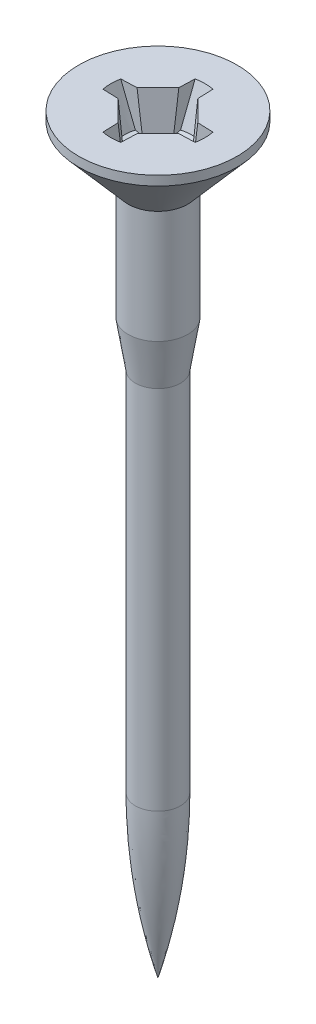
ISO-10303-21;
HEADER;
FILE_DESCRIPTION(('STEP AP214'),'2;1');
FILE_NAME('part.step','',(''),(''),'','','');
FILE_SCHEMA(('AUTOMOTIVE_DESIGN { 1 0 10303 214 1 1 1 1 }'));
ENDSEC;
DATA;
#1=APPLICATION_CONTEXT('core data for automotive mechanical design processes');
#2=APPLICATION_PROTOCOL_DEFINITION('international standard','automotive_design',2000,#1);
#3=PRODUCT_CONTEXT('',#1,'mechanical');
#4=PRODUCT('Part','Part','',(#3));
#5=PRODUCT_RELATED_PRODUCT_CATEGORY('part','',(#4));
#6=PRODUCT_DEFINITION_FORMATION('','',#4);
#7=PRODUCT_DEFINITION_CONTEXT('part definition',#1,'design');
#8=PRODUCT_DEFINITION('design','',#6,#7);
#9=PRODUCT_DEFINITION_SHAPE('','',#8);
#10=(LENGTH_UNIT() NAMED_UNIT(*) SI_UNIT(.MILLI.,.METRE.));
#11=(NAMED_UNIT(*) PLANE_ANGLE_UNIT() SI_UNIT($,.RADIAN.));
#12=(NAMED_UNIT(*) SI_UNIT($,.STERADIAN.) SOLID_ANGLE_UNIT());
#13=UNCERTAINTY_MEASURE_WITH_UNIT(LENGTH_MEASURE(1.E-05),#10,'distance_accuracy_value','');
#14=(GEOMETRIC_REPRESENTATION_CONTEXT(3) GLOBAL_UNCERTAINTY_ASSIGNED_CONTEXT((#13)) GLOBAL_UNIT_ASSIGNED_CONTEXT((#10,
#11,#12)) REPRESENTATION_CONTEXT('',''));
#15=CARTESIAN_POINT('',(0.,0.,0.));
#16=DIRECTION('',(0.,0.,1.));
#17=DIRECTION('',(1.,0.,0.));
#18=AXIS2_PLACEMENT_3D('',#15,#16,#17);
#19=CARTESIAN_POINT('',(-3.77475828372553E-12,-3.7549544092178,1.11022302462516E-12));
#20=DIRECTION('',(0.,1.00000000000008,0.));
#21=DIRECTION('',(0.,0.,1.00000000000013));
#22=AXIS2_PLACEMENT_3D('',#19,#20,#21);
#23=CONICAL_SURFACE('',#22,1.38691129987025,0.715584993317677);
#24=CARTESIAN_POINT('',(-4.21884749357559E-12,-0.500000000002054,0.));
#25=DIRECTION('',(0.,1.00000000000008,0.));
#26=DIRECTION('',(0.,0.,1.00000000000013));
#27=AXIS2_PLACEMENT_3D('',#24,#25,#26);
#28=CIRCLE('',#27,4.2164);
#29=CARTESIAN_POINT('',(-4.2406733291589E-12,-0.50000000000206,4.21640000000054));
#30=VERTEX_POINT('',#29);
#31=EDGE_CURVE('E1593',#30,#30,#28,.T.);
#32=ORIENTED_EDGE('',*,*,#31,.F.);
#33=EDGE_LOOP('',(#32));
#34=FACE_BOUND('',#33,.T.);
#35=CARTESIAN_POINT('',(-5.32907051820075E-12,-3.5242035057429,1.99840144432528E-12));
#36=DIRECTION('',(0.,1.00000000000008,0.));
#37=DIRECTION('',(0.,0.,1.00000000000013));
#38=AXIS2_PLACEMENT_3D('',#35,#36,#37);
#39=CIRCLE('',#38,1.5875);
#40=CARTESIAN_POINT('',(-5.3372880767788E-12,-3.5242035057429,1.5875000000022));
#41=VERTEX_POINT('',#40);
#42=EDGE_CURVE('E1187',#41,#41,#39,.F.);
#43=ORIENTED_EDGE('',*,*,#42,.F.);
#44=EDGE_LOOP('',(#43));
#45=FACE_BOUND('',#44,.T.);
#46=ADVANCED_FACE('F1228',(#34,#45),#23,.T.);
#47=CARTESIAN_POINT('',(0.,0.,0.));
#48=DIRECTION('',(0.,-1.00000000000008,0.));
#49=DIRECTION('',(0.,0.,-1.00000000000013));
#50=AXIS2_PLACEMENT_3D('',#47,#48,#49);
#51=PLANE('',#50);
#52=CARTESIAN_POINT('',(0.,0.,0.));
#53=DIRECTION('',(0.,1.00000000000008,0.));
#54=DIRECTION('',(0.,0.,1.00000000000013));
#55=AXIS2_PLACEMENT_3D('',#52,#53,#54);
#56=CIRCLE('',#55,4.2164);
#57=CARTESIAN_POINT('',(0.,0.,4.21640000000054));
#58=VERTEX_POINT('',#57);
#59=EDGE_CURVE('E1621',#58,#58,#56,.T.);
#60=ORIENTED_EDGE('',*,*,#59,.T.);
#61=EDGE_LOOP('',(#60));
#62=FACE_BOUND('',#61,.T.);
#63=DIRECTION('',(-0.707106781186542,0.,0.707106781186641));
#64=VECTOR('',#63,1.);
#65=CARTESIAN_POINT('',(1.06066017177753,1.77635683940025E-12,1.0606601717803));
#66=LINE('',#65,#64);
#67=CARTESIAN_POINT('',(1.61745669471158,-5.55111512312578E-13,0.503863648844138));
#68=VERTEX_POINT('',#67);
#69=CARTESIAN_POINT('',(0.503863648839475,-3.33066907387547E-13,1.61745669471558));
#70=VERTEX_POINT('',#69);
#71=EDGE_CURVE('E1617',#68,#70,#66,.T.);
#72=ORIENTED_EDGE('',*,*,#71,.T.);
#73=DIRECTION('',(-0.03489949670251,0.,0.999390827019223));
#74=VECTOR('',#73,1.);
#75=CARTESIAN_POINT('',(0.514492543158829,7.7715611723761E-13,1.31308498490745));
#76=LINE('',#75,#74);
#77=CARTESIAN_POINT('',(0.474632357923221,1.11022302462516E-13,2.4545313452502));
#78=VERTEX_POINT('',#77);
#79=EDGE_CURVE('E1615',#70,#78,#76,.T.);
#80=ORIENTED_EDGE('',*,*,#79,.T.);
#81=CARTESIAN_POINT('',(0.,0.,0.));
#82=DIRECTION('',(0.,1.00000000000007,0.));
#83=DIRECTION('',(0.,0.,1.00000000000013));
#84=AXIS2_PLACEMENT_3D('',#81,#82,#83);
#85=CIRCLE('',#84,2.5);
#86=CARTESIAN_POINT('',(-0.474632357926774,1.22124532708767E-12,2.45453134524976));
#87=VERTEX_POINT('',#86);
#88=EDGE_CURVE('E1437',#87,#78,#85,.T.);
#89=ORIENTED_EDGE('',*,*,#88,.F.);
#90=DIRECTION('',(0.0348994967024991,0.,0.999390827019236));
#91=VECTOR('',#90,1.);
#92=CARTESIAN_POINT('',(-0.514492543167711,-5.55111512312578E-13,1.31308498490745));
#93=LINE('',#92,#91);
#94=CARTESIAN_POINT('',(-0.503863648846803,1.11022302462516E-12,1.61745669471558));
#95=VERTEX_POINT('',#94);
#96=EDGE_CURVE('E1575',#95,#87,#93,.T.);
#97=ORIENTED_EDGE('',*,*,#96,.F.);
#98=DIRECTION('',(-0.707106781186579,0.,-0.707106781186655));
#99=VECTOR('',#98,1.);
#100=CARTESIAN_POINT('',(-1.06066017177842,1.11022302462516E-13,1.06066017178064));
#101=LINE('',#100,#99);
#102=CARTESIAN_POINT('',(-1.61745669471469,-6.66133814775094E-13,0.503863648846137));
#103=VERTEX_POINT('',#102);
#104=EDGE_CURVE('E1683',#95,#103,#101,.T.);
#105=ORIENTED_EDGE('',*,*,#104,.T.);
#106=DIRECTION('',(0.999390827019113,0.,0.0348994967025102));
#107=VECTOR('',#106,1.);
#108=CARTESIAN_POINT('',(-1.31308498490834,2.99760216648792E-12,0.514492543164602));
#109=LINE('',#108,#107);
#110=CARTESIAN_POINT('',(-2.45453134525087,1.99840144432528E-12,0.474632357925886));
#111=VERTEX_POINT('',#110);
#112=EDGE_CURVE('E1669',#111,#103,#109,.T.);
#113=ORIENTED_EDGE('',*,*,#112,.F.);
#114=CARTESIAN_POINT('',(-2.45453134524887,-7.7715611723761E-13,-0.47463235792633));
#115=VERTEX_POINT('',#114);
#116=EDGE_CURVE('E1682',#115,#111,#85,.T.);
#117=ORIENTED_EDGE('',*,*,#116,.F.);
#118=DIRECTION('',(0.99939082701911,0.,-0.0348994967025052));
#119=VECTOR('',#118,1.);
#120=CARTESIAN_POINT('',(-1.31308498490923,1.33226762955019E-12,-0.514492543162381));
#121=LINE('',#120,#119);
#122=CARTESIAN_POINT('',(-1.61745669471403,-1.11022302462516E-13,-0.503863648846803));
#123=VERTEX_POINT('',#122);
#124=EDGE_CURVE('E1556',#115,#123,#121,.T.);
#125=ORIENTED_EDGE('',*,*,#124,.T.);
#126=DIRECTION('',(-0.707106781186544,0.,0.707106781186638));
#127=VECTOR('',#126,1.);
#128=CARTESIAN_POINT('',(-1.06066017178241,-1.11022302462516E-12,-1.06066017177819));
#129=LINE('',#128,#127);
#130=CARTESIAN_POINT('',(-0.503863648847913,-3.33066907387547E-13,-1.61745669471614));
#131=VERTEX_POINT('',#130);
#132=EDGE_CURVE('E1357',#131,#123,#129,.T.);
#133=ORIENTED_EDGE('',*,*,#132,.F.);
#134=DIRECTION('',(0.0348994967025062,0.,-0.99939082701925));
#135=VECTOR('',#134,1.);
#136=CARTESIAN_POINT('',(-0.514492543163936,0.,-1.31308498490967));
#137=LINE('',#136,#135);
#138=CARTESIAN_POINT('',(-0.474632357927218,3.33066907387547E-13,-2.4545313452482));
#139=VERTEX_POINT('',#138);
#140=EDGE_CURVE('E1553',#131,#139,#137,.T.);
#141=ORIENTED_EDGE('',*,*,#140,.T.);
#142=CARTESIAN_POINT('',(0.474632357925442,3.33066907387547E-13,-2.45453134524998));
#143=VERTEX_POINT('',#142);
#144=EDGE_CURVE('E1371',#143,#139,#85,.T.);
#145=ORIENTED_EDGE('',*,*,#144,.F.);
#146=DIRECTION('',(-0.0348994967024975,0.,-0.999390827019235));
#147=VECTOR('',#146,1.);
#148=CARTESIAN_POINT('',(0.514492543161493,1.11022302462516E-12,-1.31308498490679));
#149=LINE('',#148,#147);
#150=CARTESIAN_POINT('',(0.503863648841918,-1.4432899320127E-12,-1.61745669471458));
#151=VERTEX_POINT('',#150);
#152=EDGE_CURVE('E1363',#151,#143,#149,.T.);
#153=ORIENTED_EDGE('',*,*,#152,.F.);
#154=DIRECTION('',(-0.707106781186579,0.,-0.707106781186655));
#155=VECTOR('',#154,1.);
#156=CARTESIAN_POINT('',(1.06066017177708,-1.66533453693773E-12,-1.06066017177819));
#157=LINE('',#156,#155);
#158=CARTESIAN_POINT('',(1.61745669470847,-1.11022302462516E-13,-0.503863648845138));
#159=VERTEX_POINT('',#158);
#160=EDGE_CURVE('E1346',#159,#151,#157,.T.);
#161=ORIENTED_EDGE('',*,*,#160,.F.);
#162=DIRECTION('',(-0.999390827019116,0.,-0.0348994967025101));
#163=VECTOR('',#162,1.);
#164=CARTESIAN_POINT('',(1.31308498490545,-1.55431223447522E-12,-0.514492543162826));
#165=LINE('',#164,#163);
#166=CARTESIAN_POINT('',(2.45453134524576,-7.7715611723761E-13,-0.474632357924665));
#167=VERTEX_POINT('',#166);
#168=EDGE_CURVE('E1374',#167,#159,#165,.T.);
#169=ORIENTED_EDGE('',*,*,#168,.F.);
#170=CARTESIAN_POINT('',(2.45453134524776,-1.77635683940025E-12,0.474632357927329));
#171=VERTEX_POINT('',#170);
#172=EDGE_CURVE('E1444',#171,#167,#85,.T.);
#173=ORIENTED_EDGE('',*,*,#172,.F.);
#174=DIRECTION('',(-0.999390827019114,0.,0.0348994967025036));
#175=VECTOR('',#174,1.);
#176=CARTESIAN_POINT('',(1.31308498490279,8.88178419700125E-13,0.514492543162604));
#177=LINE('',#176,#175);
#178=EDGE_CURVE('E1599',#171,#68,#177,.T.);
#179=ORIENTED_EDGE('',*,*,#178,.T.);
#180=EDGE_LOOP('',(#72,#80,#89,#97,#105,#113,#117,#125,#133,#141,#145,#153,#161,#169,#173,#179));
#181=FACE_BOUND('',#180,.T.);
#182=ADVANCED_FACE('F1230',(#62,#181),#51,.F.);
#183=CARTESIAN_POINT('',(0.474632357922555,-9.99200722162641E-13,2.45453134525153));
#184=DIRECTION('',(0.999390372463438,0.000953763748978098,0.0348994808290792));
#185=DIRECTION('',(0.03489949670251,0.,-0.999390827019223));
#186=AXIS2_PLACEMENT_3D('',#183,#184,#185);
#187=PLANE('',#186);
#188=DIRECTION('',(0.00542075140180975,-0.991742982107326,-0.128126784456948));
#189=VECTOR('',#188,1.);
#190=CARTESIAN_POINT('',(0.503281405179301,0.106523251443891,1.63121881042749));
#191=LINE('',#190,#189);
#192=CARTESIAN_POINT('',(0.515311755265202,-2.09446594278406,1.34686522973304));
#193=VERTEX_POINT('',#192);
#194=EDGE_CURVE('E1366',#193,#70,#191,.F.);
#195=ORIENTED_EDGE('',*,*,#194,.F.);
#196=CARTESIAN_POINT('',(0.529925638486306,-2.19869243479687,0.93122676147972));
#197=CARTESIAN_POINT('',(0.527646544941195,-2.18313770004151,0.996066368006957));
#198=CARTESIAN_POINT('',(0.525370369533032,-2.16719979051094,1.06081193828579));
#199=CARTESIAN_POINT('',(0.520822461694871,-2.13476419611156,1.19016055055889));
#200=CARTESIAN_POINT('',(0.518550729098448,-2.11826653265264,1.25476359790403));
#201=CARTESIAN_POINT('',(0.5140101966335,-2.0849172029941,1.38387603575444));
#202=CARTESIAN_POINT('',(0.511741396692815,-2.06806554568779,1.44838542856914));
#203=CARTESIAN_POINT('',(0.507205838880249,-2.0341030499394,1.57733865388103));
#204=CARTESIAN_POINT('',(0.50493908108723,-2.01699220190736,1.64178248385781));
#205=CARTESIAN_POINT('',(0.502673011703925,-1.99980000000066,1.70620437706281));
#206=B_SPLINE_CURVE_WITH_KNOTS('',3,(#196,#197,#198,#199,#200,#201,#202,#203,#204,#205),
.UNSPECIFIED.,.F.,.F.,(4,2,2,2,4),(0.,0.200150396934308,0.400293146977355,0.600430874873457,
0.800576025976701),.UNSPECIFIED.);
#207=CARTESIAN_POINT('',(0.502699365342973,-2.00000000000233,1.70545517328746));
#208=VERTEX_POINT('',#207);
#209=EDGE_CURVE('E1430',#193,#208,#206,.T.);
#210=ORIENTED_EDGE('',*,*,#209,.T.);
#211=CARTESIAN_POINT('',(0.502702214071338,-2.00020000000156,1.70537906225476));
#212=CARTESIAN_POINT('',(0.50033284553185,-1.83382636419747,1.76868209458039));
#213=CARTESIAN_POINT('',(0.497973680496886,-1.66734070411179,1.83168987529349));
#214=CARTESIAN_POINT('',(0.49327147366532,-1.33419419003663,1.95723893975097));
#215=CARTESIAN_POINT('',(0.490928431792209,-1.16753333688283,2.01978022570913));
#216=CARTESIAN_POINT('',(0.486254170234648,-0.83408407713395,2.14452076853686));
#217=CARTESIAN_POINT('',(0.483922950524199,-0.667295670820298,2.20672002615859));
#218=CARTESIAN_POINT('',(0.47926986262526,-0.333617161236778,2.33084796959255));
#219=CARTESIAN_POINT('',(0.476947994480745,-0.166727057492915,2.39277665413252));
#220=CARTESIAN_POINT('',(0.4746295803153,0.00020000000044984,2.45460541975773));
#221=B_SPLINE_CURVE_WITH_KNOTS('',3,(#211,#212,#213,#214,#215,#216,#217,#218,#219,#220),
.UNSPECIFIED.,.F.,.F.,(4,2,2,2,4),(0.,0.534075570934745,1.06814860575873,1.60222046560651,
2.13629483401979),.UNSPECIFIED.);
#222=EDGE_CURVE('E1422',#208,#78,#221,.T.);
#223=ORIENTED_EDGE('',*,*,#222,.T.);
#224=ORIENTED_EDGE('',*,*,#79,.F.);
#225=EDGE_LOOP('',(#195,#210,#223,#224));
#226=FACE_BOUND('',#225,.T.);
#227=ADVANCED_FACE('F1413',(#226),#187,.F.);
#228=CARTESIAN_POINT('',(1.31308498490279,8.88178419700125E-13,0.514492543162604));
#229=DIRECTION('',(0.0348994808290635,0.00095376374898265,0.999390372463575));
#230=DIRECTION('',(0.999390827019114,0.,-0.0348994967025036));
#231=AXIS2_PLACEMENT_3D('',#228,#229,#230);
#232=PLANE('',#231);
#233=DIRECTION('',(0.128126784456931,0.991742982107364,-0.00542075140180429));
#234=VECTOR('',#233,1.);
#235=CARTESIAN_POINT('',(1.61245260255805,-0.0387333007337842,0.504075360547196));
#236=LINE('',#235,#234);
#237=CARTESIAN_POINT('',(1.3468652297437,-2.09446594278029,0.515311755258652));
#238=VERTEX_POINT('',#237);
#239=EDGE_CURVE('E1236',#68,#238,#236,.F.);
#240=ORIENTED_EDGE('',*,*,#239,.F.);
#241=ORIENTED_EDGE('',*,*,#178,.F.);
#242=CARTESIAN_POINT('',(2.45460541975606,0.000199999998229394,0.474629580320185));
#243=CARTESIAN_POINT('',(2.39277665413098,-0.166727057495153,0.476947994484568));
#244=CARTESIAN_POINT('',(2.33084796959106,-0.333617161238997,0.479269862628619));
#245=CARTESIAN_POINT('',(2.20672002615712,-0.667295670822444,0.4839229505272));
#246=CARTESIAN_POINT('',(2.14452076853537,-0.834084077136045,0.486254170237753));
#247=CARTESIAN_POINT('',(2.01978022570761,-1.16753333688482,0.490928431795461));
#248=CARTESIAN_POINT('',(1.95723893974943,-1.33419419003857,0.493271473668615));
#249=CARTESIAN_POINT('',(1.83168987529194,-1.66734070411364,0.497973680499947));
#250=CARTESIAN_POINT('',(1.76868209457884,-1.83382636419928,0.500332845534635));
#251=CARTESIAN_POINT('',(1.70537906225321,-2.00020000000334,0.502702214073558));
#252=B_SPLINE_CURVE_WITH_KNOTS('',3,(#242,#243,#244,#245,#246,#247,#248,#249,#250,#251),
.UNSPECIFIED.,.F.,.F.,(4,2,2,2,4),(0.,0.534074368413153,1.06814622826082,1.60221926308468,
2.1362948340193),.UNSPECIFIED.);
#253=CARTESIAN_POINT('',(1.70545517328446,-2.00000000000256,0.502699365347414));
#254=VERTEX_POINT('',#253);
#255=EDGE_CURVE('E1609',#171,#254,#252,.T.);
#256=ORIENTED_EDGE('',*,*,#255,.T.);
#257=CARTESIAN_POINT('',(1.70620437706082,-1.99980000000266,0.502673011705701));
#258=CARTESIAN_POINT('',(1.64178248385557,-2.01699220190758,0.504939081089926));
#259=CARTESIAN_POINT('',(1.5773386538788,-2.03410304993885,0.507205838883312));
#260=CARTESIAN_POINT('',(1.44838542856716,-2.06806554568661,0.511741396696132));
#261=CARTESIAN_POINT('',(1.3838760357527,-2.08491720299307,0.514010196636704));
#262=CARTESIAN_POINT('',(1.25476359790273,-2.11826653265176,0.518550729101575));
#263=CARTESIAN_POINT('',(1.19016055055778,-2.13476419611067,0.520822461698034));
#264=CARTESIAN_POINT('',(1.06081193828501,-2.1671997905098,0.525370369536152));
#265=CARTESIAN_POINT('',(0.99606636800631,-2.18313770004013,0.527646544944237));
#266=CARTESIAN_POINT('',(0.931226761479165,-2.19869243479509,0.529925638489082));
#267=B_SPLINE_CURVE_WITH_KNOTS('',3,(#257,#258,#259,#260,#261,#262,#263,#264,#265,#266),
.UNSPECIFIED.,.F.,.F.,(4,2,2,2,4),(0.,0.200145151102657,0.400282878998175,0.600425629040651,
0.800576025974385),.UNSPECIFIED.);
#268=EDGE_CURVE('E1438',#254,#238,#267,.T.);
#269=ORIENTED_EDGE('',*,*,#268,.T.);
#270=EDGE_LOOP('',(#240,#241,#256,#269));
#271=FACE_BOUND('',#270,.T.);
#272=ADVANCED_FACE('F1417',(#271),#232,.F.);
#273=CARTESIAN_POINT('',(-0.474632357926774,1.22124532708767E-12,2.45453134524976));
#274=DIRECTION('',(-0.999390372463437,0.000953763748976544,0.0348994808290695));
#275=DIRECTION('',(-0.0348994967024991,0.,-0.999390827019236));
#276=AXIS2_PLACEMENT_3D('',#273,#274,#275);
#277=PLANE('',#276);
#278=DIRECTION('',(0.0054207514017976,0.991742982107341,0.128126784456945));
#279=VECTOR('',#278,1.);
#280=CARTESIAN_POINT('',(-0.503281405186629,0.106523251446444,1.63121881042749));
#281=LINE('',#280,#279);
#282=CARTESIAN_POINT('',(-0.515311755264536,-2.09446594278206,1.3468652297447));
#283=VERTEX_POINT('',#282);
#284=EDGE_CURVE('E1872',#95,#283,#281,.F.);
#285=ORIENTED_EDGE('',*,*,#284,.F.);
#286=ORIENTED_EDGE('',*,*,#96,.T.);
#287=CARTESIAN_POINT('',(-0.474629580319963,0.00020000000189313,2.45460541975728));
#288=CARTESIAN_POINT('',(-0.476947994485124,-0.166727057491301,2.39277665413216));
#289=CARTESIAN_POINT('',(-0.479269862629489,-0.333617161235002,2.33084796959231));
#290=CARTESIAN_POINT('',(-0.483922950528292,-0.667295670818177,2.20672002615851));
#291=CARTESIAN_POINT('',(-0.486254170238754,-0.834084077131647,2.14452076853684));
#292=CARTESIAN_POINT('',(-0.490928431796408,-1.1675333368801,2.01978022570907));
#293=CARTESIAN_POINT('',(-0.493271473669596,-1.33419419003365,1.9572389397508));
#294=CARTESIAN_POINT('',(-0.4979736805009,-1.66734070410858,1.83168987529379));
#295=CARTESIAN_POINT('',(-0.500332845535525,-1.83382636419428,1.76868209458127));
#296=CARTESIAN_POINT('',(-0.502702214074224,-2.00019999999868,1.70537906225698));
#297=B_SPLINE_CURVE_WITH_KNOTS('',3,(#287,#288,#289,#290,#291,#292,#293,#294,#295,#296),
.UNSPECIFIED.,.F.,.F.,(4,2,2,2,4),(0.,0.534074368412697,1.06814622825991,1.60221926308331,
2.13629483401747),.UNSPECIFIED.);
#298=CARTESIAN_POINT('',(-0.502699365348525,-1.99999999999956,1.70545517328569));
#299=VERTEX_POINT('',#298);
#300=EDGE_CURVE('E1516',#87,#299,#297,.T.);
#301=ORIENTED_EDGE('',*,*,#300,.T.);
#302=CARTESIAN_POINT('',(-0.50267301171103,-1.99979999999977,1.70620437706215));
#303=CARTESIAN_POINT('',(-0.504939081092349,-2.01699220190744,1.6417824838573));
#304=CARTESIAN_POINT('',(-0.507205838884645,-2.03410304993985,1.57733865388057));
#305=CARTESIAN_POINT('',(-0.511741396696746,-2.06806554568851,1.44838542856869));
#306=CARTESIAN_POINT('',(-0.514010196637688,-2.08491720299473,1.38387603575395));
#307=CARTESIAN_POINT('',(-0.518550729102586,-2.11826653265334,1.25476359790351));
#308=CARTESIAN_POINT('',(-0.520822461698702,-2.13476419611242,1.19016055055837));
#309=CARTESIAN_POINT('',(-0.525370369537527,-2.16719979051158,1.06081193828519));
#310=CARTESIAN_POINT('',(-0.52764654494666,-2.18313770004178,0.996066368006267));
#311=CARTESIAN_POINT('',(-0.5299256384943,-2.19869243479609,0.931226761478832));
#312=B_SPLINE_CURVE_WITH_KNOTS('',3,(#302,#303,#304,#305,#306,#307,#308,#309,#310,#311),
.UNSPECIFIED.,.F.,.F.,(4,2,2,2,4),(0.,0.200145151103321,0.400282878999493,0.600425629042611,
0.800576025977003),.UNSPECIFIED.);
#313=EDGE_CURVE('E1564',#299,#283,#312,.T.);
#314=ORIENTED_EDGE('',*,*,#313,.T.);
#315=EDGE_LOOP('',(#285,#286,#301,#314));
#316=FACE_BOUND('',#315,.T.);
#317=ADVANCED_FACE('F1530',(#316),#277,.F.);
#318=CARTESIAN_POINT('',(-1.31308498490834,2.99760216648792E-12,0.514492543164602));
#319=DIRECTION('',(-0.0348994808290758,0.000953763748975767,0.999390372463567));
#320=DIRECTION('',(-0.999390827019113,0.,-0.0348994967025102));
#321=AXIS2_PLACEMENT_3D('',#318,#319,#320);
#322=PLANE('',#321);
#323=DIRECTION('',(0.128126784456933,-0.991742982107282,0.00542075140180384));
#324=VECTOR('',#323,1.);
#325=CARTESIAN_POINT('',(-1.61245260256204,-0.0387333007348944,0.504075360546752));
#326=LINE('',#325,#324);
#327=CARTESIAN_POINT('',(-1.34686522974525,-2.09446594278195,0.515311755260317));
#328=VERTEX_POINT('',#327);
#329=EDGE_CURVE('E1619',#328,#103,#326,.F.);
#330=ORIENTED_EDGE('',*,*,#329,.F.);
#331=CARTESIAN_POINT('',(-0.931226761483606,-2.19869243479398,0.529925638489193));
#332=CARTESIAN_POINT('',(-0.996066368011159,-2.1831377000404,0.527646544945622));
#333=CARTESIAN_POINT('',(-1.06081193829001,-2.16719979051052,0.525370369538006));
#334=CARTESIAN_POINT('',(-1.19016055056288,-2.13476419611166,0.520822461700193));
#335=CARTESIAN_POINT('',(-1.25476359790779,-2.11826653265256,0.51855072910357));
#336=CARTESIAN_POINT('',(-1.38387603575785,-2.08491720299408,0.514010196638714));
#337=CARTESIAN_POINT('',(-1.44838542857244,-2.06806554568801,0.511741396698321));
#338=CARTESIAN_POINT('',(-1.57733865388385,-2.03410304993931,0.50720583888512));
#339=CARTESIAN_POINT('',(-1.64178248386027,-2.01699220190671,0.504939081091174));
#340=CARTESIAN_POINT('',(-1.70620437706459,-1.99979999999844,0.502673011705479));
#341=B_SPLINE_CURVE_WITH_KNOTS('',3,(#331,#332,#333,#334,#335,#336,#337,#338,#339,#340),
.UNSPECIFIED.,.F.,.F.,(4,2,2,2,4),(0.,0.200150396933794,0.400293146976306,0.600430874871869,
0.800576025974587),.UNSPECIFIED.);
#342=CARTESIAN_POINT('',(-1.70545517328424,-2.00000000000078,0.502699365349635));
#343=VERTEX_POINT('',#342);
#344=EDGE_CURVE('E1508',#328,#343,#341,.T.);
#345=ORIENTED_EDGE('',*,*,#344,.T.);
#346=CARTESIAN_POINT('',(-1.70537906225632,-2.00020000000001,0.50270221407267));
#347=CARTESIAN_POINT('',(-1.7686820945806,-1.83382636419541,0.500332845535758));
#348=CARTESIAN_POINT('',(-1.83168987529314,-1.66734070410954,0.497973680501829));
#349=CARTESIAN_POINT('',(-1.95723893975024,-1.33419419003429,0.493271473671007));
#350=CARTESIAN_POINT('',(-2.01978022570857,-1.1675333368806,0.490928431797604));
#351=CARTESIAN_POINT('',(-2.14452076853652,-0.834084077131875,0.486254170239883));
#352=CARTESIAN_POINT('',(-2.20672002615831,-0.667295670818274,0.483922950529566));
#353=CARTESIAN_POINT('',(-2.33084796959208,-0.33361716123475,0.479269862630525));
#354=CARTESIAN_POINT('',(-2.39277665413179,-0.166727057490832,0.476947994485776));
#355=CARTESIAN_POINT('',(-2.45460541975651,0.000200000002670286,0.474629580319519));
#356=B_SPLINE_CURVE_WITH_KNOTS('',3,(#346,#347,#348,#349,#350,#351,#352,#353,#354,#355),
.UNSPECIFIED.,.F.,.F.,(4,2,2,2,4),(0.,0.534075570934642,1.06814860575853,1.60222046560622,
2.1362948340194),.UNSPECIFIED.);
#357=EDGE_CURVE('E1517',#343,#111,#356,.T.);
#358=ORIENTED_EDGE('',*,*,#357,.T.);
#359=ORIENTED_EDGE('',*,*,#112,.T.);
#360=EDGE_LOOP('',(#330,#345,#358,#359));
#361=FACE_BOUND('',#360,.T.);
#362=ADVANCED_FACE('F1451',(#361),#322,.F.);
#363=CARTESIAN_POINT('',(-4.66293670342566E-12,-2.00000000000033,1.77635683940025E-12));
#364=DIRECTION('',(0.,1.00000000000007,0.));
#365=DIRECTION('',(0.,0.,1.00000000000013));
#366=AXIS2_PLACEMENT_3D('',#363,#364,#365);
#367=CONICAL_SURFACE('',#366,1.778,1.29666145108731);
#368=ORIENTED_EDGE('',*,*,#209,.F.);
#369=CARTESIAN_POINT('',(1.61765669471214,-2.03963427623988,0.251304483780967));
#370=CARTESIAN_POINT('',(1.56741027844648,-2.05148254720165,0.300084941272185));
#371=CARTESIAN_POINT('',(1.51710748265194,-2.06255207251554,0.349018130663752));
#372=CARTESIAN_POINT('',(1.41638707305759,-2.08265492127836,0.447251261932155));
#373=CARTESIAN_POINT('',(1.36596940387212,-2.09168682947615,0.496551434300346));
#374=CARTESIAN_POINT('',(1.2651399535491,-2.10720980497904,0.595460263273195));
#375=CARTESIAN_POINT('',(1.21472822206417,-2.11370353649637,0.645068540588508));
#376=CARTESIAN_POINT('',(1.11394950027076,-2.12369334049015,0.744611247364734));
#377=CARTESIAN_POINT('',(1.06358250158102,-2.12719021780318,0.79454558562637));
#378=CARTESIAN_POINT('',(0.963608135207353,-2.13086570210958,0.894065192947651));
#379=CARTESIAN_POINT('',(0.913999050364158,-2.1310846370607,0.943647189482941));
#380=CARTESIAN_POINT('',(0.815025127525352,-2.12829136360117,1.04296671749504));
#381=CARTESIAN_POINT('',(0.765660315894427,-2.12527881373818,1.09270426485426));
#382=CARTESIAN_POINT('',(0.618096721686648,-2.11176540846891,1.24193984100187));
#383=CARTESIAN_POINT('',(0.52037169565118,-2.0967904772441,1.34151768015846));
#384=CARTESIAN_POINT('',(0.408991572507511,-2.074838873238,1.45561382377439));
#385=CARTESIAN_POINT('',(0.394625306188956,-2.07191324932116,1.47034207067745));
#386=CARTESIAN_POINT('',(0.365922039528574,-2.06589293799384,1.49979021633728));
#387=CARTESIAN_POINT('',(0.351585035681286,-2.06279827223688,1.51451011592037));
#388=CARTESIAN_POINT('',(0.322909636736631,-2.05644446484875,1.54397165655049));
#389=CARTESIAN_POINT('',(0.308571296792953,-2.05318500505041,1.55871328180989));
#390=CARTESIAN_POINT('',(0.279919311294577,-2.0465179445651,1.58819016706468));
#391=CARTESIAN_POINT('',(0.265605668519571,-2.04311032820661,1.60292542621937));
#392=CARTESIAN_POINT('',(0.251304483781967,-2.0396342762381,1.61765669471459));
#393=B_SPLINE_CURVE_WITH_KNOTS('',3,(#369,#370,#371,#372,#373,#374,#375,#376,#377,#378,#379,
#380,#381,#382,#383,#384,#385,#386,#387,#388,#389,#390,#391,#392),.UNSPECIFIED.,.F.,.F.,(4,2,2,
2,2,2,2,2,2,2,2,4),(0.,0.213094466260223,0.426336487235371,0.639354072477329,0.852314431672003,
1.06265259304477,1.27301298182517,1.69349281924277,1.75583900653258,1.81817722619362,
1.88064077578751,1.94311094872721),.UNSPECIFIED.);
#394=EDGE_CURVE('E1243',#238,#193,#393,.T.);
#395=ORIENTED_EDGE('',*,*,#394,.F.);
#396=ORIENTED_EDGE('',*,*,#268,.F.);
#397=CARTESIAN_POINT('',(-4.66293670342566E-12,-2.00000000000033,1.77635683940025E-12));
#398=DIRECTION('',(0.,1.00000000000007,0.));
#399=DIRECTION('',(0.,0.,1.00000000000013));
#400=AXIS2_PLACEMENT_3D('',#397,#398,#399);
#401=CIRCLE('',#400,1.778);
#402=CARTESIAN_POINT('',(1.70545517328002,-2.00000000000011,-0.502699365348636));
#403=VERTEX_POINT('',#402);
#404=EDGE_CURVE('E1585',#254,#403,#401,.T.);
#405=ORIENTED_EDGE('',*,*,#404,.T.);
#406=CARTESIAN_POINT('',(0.931226761475834,-2.19869243479465,-0.529925638493189));
#407=CARTESIAN_POINT('',(0.996066368003458,-2.18313770004009,-0.527646544945934));
#408=CARTESIAN_POINT('',(1.06081193828261,-2.16719979050986,-0.525370369536877));
#409=CARTESIAN_POINT('',(1.19016055055626,-2.13476419611068,-0.520822461698046));
#410=CARTESIAN_POINT('',(1.25476359790165,-2.11826653265162,-0.518550729101846));
#411=CARTESIAN_POINT('',(1.38387603575251,-2.08491720299276,-0.514010196637074));
#412=CARTESIAN_POINT('',(1.44838542856742,-2.06806554568627,-0.511741396696343));
#413=CARTESIAN_POINT('',(1.57733865387989,-2.03410304993814,-0.507205838883647));
#414=CARTESIAN_POINT('',(1.64178248385705,-2.01699220190653,-0.504939081090545));
#415=CARTESIAN_POINT('',(1.70620437706259,-1.99980000000088,-0.502673011707255));
#416=B_SPLINE_CURVE_WITH_KNOTS('',3,(#406,#407,#408,#409,#410,#411,#412,#413,#414,#415),
.UNSPECIFIED.,.F.,.F.,(4,2,2,2,4),(0.,0.200150396935081,0.4002931469789,0.60043087487576,
0.800576025979763),.UNSPECIFIED.);
#417=CARTESIAN_POINT('',(1.34686522972749,-2.09446594278428,-0.515311755271086));
#418=VERTEX_POINT('',#417);
#419=EDGE_CURVE('E1377',#418,#403,#416,.T.);
#420=ORIENTED_EDGE('',*,*,#419,.F.);
#421=CARTESIAN_POINT('',(1.6176566947117,-2.03963427623755,-0.251304483783743));
#422=CARTESIAN_POINT('',(1.56741027844471,-2.05148254720111,-0.30008494127342));
#423=CARTESIAN_POINT('',(1.51710748264956,-2.06255207251573,-0.349018130664418));
#424=CARTESIAN_POINT('',(1.41638707305461,-2.08265492127903,-0.447251261932542));
#425=CARTESIAN_POINT('',(1.36596940386917,-2.09168682947658,-0.496551434301022));
#426=CARTESIAN_POINT('',(1.26513995354604,-2.10720980497922,-0.595460263274235));
#427=CARTESIAN_POINT('',(1.21472822206097,-2.11370353649654,-0.645068540589621));
#428=CARTESIAN_POINT('',(1.1139495002673,-2.12369334049021,-0.744611247366009));
#429=CARTESIAN_POINT('',(1.06358250157742,-2.12719021780314,-0.794545585627734));
#430=CARTESIAN_POINT('',(0.963608135203688,-2.13086570210936,-0.894065192949325));
#431=CARTESIAN_POINT('',(0.913999050360555,-2.13108463706042,-0.943647189484835));
#432=CARTESIAN_POINT('',(0.815025127521224,-2.12829136360061,-1.04296671749671));
#433=CARTESIAN_POINT('',(0.765660315889712,-2.12527881373741,-1.09270426485549));
#434=CARTESIAN_POINT('',(0.618096721683841,-2.1117654084683,-1.24193984100549));
#435=CARTESIAN_POINT('',(0.520371695654531,-2.09679047724468,-1.34151768016862));
#436=CARTESIAN_POINT('',(0.408991572504572,-2.07483887323704,-1.45561382377825));
#437=CARTESIAN_POINT('',(0.39462530618504,-2.07191324931997,-1.47034207068014));
#438=CARTESIAN_POINT('',(0.365922039524063,-2.06589293799249,-1.49979021633901));
#439=CARTESIAN_POINT('',(0.351585035677155,-2.06279827223559,-1.51451011592231));
#440=CARTESIAN_POINT('',(0.322909636732858,-2.05644446484751,-1.54397165655244));
#441=CARTESIAN_POINT('',(0.308571296789155,-2.05318500504914,-1.55871328181165));
#442=CARTESIAN_POINT('',(0.279919311290988,-2.04651794456386,-1.5881901670663));
#443=CARTESIAN_POINT('',(0.265605668516216,-2.04311032820543,-1.60292542622105));
#444=CARTESIAN_POINT('',(0.251304483779302,-2.0396342762371,-1.61765669471681));
#445=B_SPLINE_CURVE_WITH_KNOTS('',3,(#421,#422,#423,#424,#425,#426,#427,#428,#429,#430,#431,
#432,#433,#434,#435,#436,#437,#438,#439,#440,#441,#442,#443,#444),.UNSPECIFIED.,.F.,.F.,(4,2,2,
2,2,2,2,2,2,2,2,4),(0.,0.213094466260688,0.426336487236275,0.639354072478679,0.852314431673807,
1.0626525930469,1.27301298182764,1.6934928192459,1.75583900653534,1.81817722619601,
1.88064077578954,1.94311094872887),.UNSPECIFIED.);
#446=CARTESIAN_POINT('',(0.515311755257652,-2.09446594278206,-1.34686522974259));
#447=VERTEX_POINT('',#446);
#448=EDGE_CURVE('E1460',#418,#447,#445,.T.);
#449=ORIENTED_EDGE('',*,*,#448,.T.);
#450=CARTESIAN_POINT('',(0.502673011703925,-1.99980000000033,-1.70620437706415));
#451=CARTESIAN_POINT('',(0.50493908108898,-2.01699220190623,-1.6417824838591));
#452=CARTESIAN_POINT('',(0.507205838882745,-2.03410304993795,-1.57733865388237));
#453=CARTESIAN_POINT('',(0.511741396695874,-2.06806554568608,-1.44838542857065));
#454=CARTESIAN_POINT('',(0.514010196636376,-2.08491720299246,-1.38387603575607));
#455=CARTESIAN_POINT('',(0.518550729101103,-2.11826653265095,-1.25476359790586));
#456=CARTESIAN_POINT('',(0.520822461697489,-2.13476419610974,-1.19016055056079));
#457=CARTESIAN_POINT('',(0.52537036953592,-2.16719979050926,-1.06081193828796));
#458=CARTESIAN_POINT('',(0.527646544944391,-2.18313770004009,-0.996066368009305));
#459=CARTESIAN_POINT('',(0.529925638490081,-2.1986924347962,-0.931226761482384));
#460=B_SPLINE_CURVE_WITH_KNOTS('',3,(#450,#451,#452,#453,#454,#455,#456,#457,#458,#459),
.UNSPECIFIED.,.F.,.F.,(4,2,2,2,4),(0.,0.200145151102927,0.400282878998717,0.60042562904145,
0.800576025975435),.UNSPECIFIED.);
#461=CARTESIAN_POINT('',(0.50269936534808,-2.00000000000011,-1.70545517328402));
#462=VERTEX_POINT('',#461);
#463=EDGE_CURVE('E1365',#462,#447,#460,.T.);
#464=ORIENTED_EDGE('',*,*,#463,.F.);
#465=CARTESIAN_POINT('',(-0.502699365347414,-2.000000000001,-1.70545517328491));
#466=VERTEX_POINT('',#465);
#467=EDGE_CURVE('E1587',#462,#466,#401,.T.);
#468=ORIENTED_EDGE('',*,*,#467,.T.);
#469=CARTESIAN_POINT('',(-0.5299256384943,-2.19869243479531,-0.931226761481718));
#470=CARTESIAN_POINT('',(-0.527646544948392,-2.18313770004025,-0.996066368008894));
#471=CARTESIAN_POINT('',(-0.525370369539877,-2.16719979050983,-1.06081193828765));
#472=CARTESIAN_POINT('',(-0.520822461701444,-2.13476419611058,-1.19016055056056));
#473=CARTESIAN_POINT('',(-0.518550729105101,-2.11826653265165,-1.2547635979056));
#474=CARTESIAN_POINT('',(-0.514010196640287,-2.08491720299301,-1.38387603575578));
#475=CARTESIAN_POINT('',(-0.511741396699655,-2.06806554568663,-1.44838542857035));
#476=CARTESIAN_POINT('',(-0.507205838886871,-2.03410304993852,-1.57733865388209));
#477=CARTESIAN_POINT('',(-0.504939081093583,-2.01699220190682,-1.64178248385885));
#478=CARTESIAN_POINT('',(-0.502673011709698,-1.99980000000088,-1.70620437706392));
#479=B_SPLINE_CURVE_WITH_KNOTS('',3,(#469,#470,#471,#472,#473,#474,#475,#476,#477,#478),
.UNSPECIFIED.,.F.,.F.,(4,2,2,2,4),(0.,0.200150396934004,0.400293146976747,0.600430874872538,
0.800576025975471),.UNSPECIFIED.);
#480=CARTESIAN_POINT('',(-0.515311755262537,-2.09446594278184,-1.34686522974359));
#481=VERTEX_POINT('',#480);
#482=EDGE_CURVE('E1379',#481,#466,#479,.T.);
#483=ORIENTED_EDGE('',*,*,#482,.F.);
#484=CARTESIAN_POINT('',(-0.251304483784409,-2.03963427623699,-1.61765669471303));
#485=CARTESIAN_POINT('',(-0.300084941275204,-2.05148254720111,-1.56741027844689));
#486=CARTESIAN_POINT('',(-0.349018130666767,-2.06255207251599,-1.51710748265199));
#487=CARTESIAN_POINT('',(-0.447251261935511,-2.08265492127958,-1.41638707305703));
#488=CARTESIAN_POINT('',(-0.496551434304047,-2.09168682947714,-1.36596940387132));
#489=CARTESIAN_POINT('',(-0.595460263277377,-2.10720980497984,-1.26513995354793));
#490=CARTESIAN_POINT('',(-0.645068540592826,-2.11370353649721,-1.21472822206286));
#491=CARTESIAN_POINT('',(-0.74461124736934,-2.12369334049096,-1.11394950026914));
#492=CARTESIAN_POINT('',(-0.794545585631129,-2.12719021780394,-1.06358250157922));
#493=CARTESIAN_POINT('',(-0.894065192952752,-2.13086570211015,-0.963608135205383));
#494=CARTESIAN_POINT('',(-0.94364718948823,-2.13108463706117,-0.913999050362182));
#495=CARTESIAN_POINT('',(-1.04296671750032,-2.12829136360156,-0.815025127522982));
#496=CARTESIAN_POINT('',(-1.09270426485934,-2.1252788137386,-0.765660315891668));
#497=CARTESIAN_POINT('',(-1.2419398410085,-2.11176540846852,-0.618096721684912));
#498=CARTESIAN_POINT('',(-1.3415176801689,-2.09679047724198,-0.52037169565314));
#499=CARTESIAN_POINT('',(-1.4556138237811,-2.07483887323727,-0.408991572505834));
#500=CARTESIAN_POINT('',(-1.47034207068306,-2.07191324932078,-0.394625306187104));
#501=CARTESIAN_POINT('',(-1.49979021634145,-2.06589293799377,-0.365922039527232));
#502=CARTESIAN_POINT('',(-1.51451011592421,-2.06279827223677,-0.351585035680628));
#503=CARTESIAN_POINT('',(-1.54397165655344,-2.05644446484895,-0.322909636737044));
#504=CARTESIAN_POINT('',(-1.5587132818123,-2.05318500505094,-0.308571296793751));
#505=CARTESIAN_POINT('',(-1.58819016706608,-2.04651794456529,-0.279919311296466));
#506=CARTESIAN_POINT('',(-1.60292542622031,-2.04311032820613,-0.265605668522167));
#507=CARTESIAN_POINT('',(-1.61765669471525,-2.03963427623577,-0.251304483785741));
#508=B_SPLINE_CURVE_WITH_KNOTS('',3,(#484,#485,#486,#487,#488,#489,#490,#491,#492,#493,#494,
#495,#496,#497,#498,#499,#500,#501,#502,#503,#504,#505,#506,#507),.UNSPECIFIED.,.F.,.F.,(4,2,2,
2,2,2,2,2,2,2,2,4),(0.,0.213094466261449,0.426336487237717,0.639354072480275,0.852314431675615,
1.06265259304881,1.27301298182955,1.69349281924826,1.75583900653596,1.81817722619488,
1.88064077578665,1.94311094872425),.UNSPECIFIED.);
#509=CARTESIAN_POINT('',(-1.34686522974503,-2.09446594278184,-0.515311755259318));
#510=VERTEX_POINT('',#509);
#511=EDGE_CURVE('E1250',#481,#510,#508,.T.);
#512=ORIENTED_EDGE('',*,*,#511,.T.);
#513=CARTESIAN_POINT('',(-1.70620437706503,-1.99979999999622,-0.502673011705701));
#514=CARTESIAN_POINT('',(-1.64178248386079,-2.01699220190573,-0.504939081089646));
#515=CARTESIAN_POINT('',(-1.57733865388431,-2.03410304993887,-0.507205838883044));
#516=CARTESIAN_POINT('',(-1.44838542857264,-2.06806554568803,-0.511741396695969));
#517=CARTESIAN_POINT('',(-1.38387603575785,-2.08491720299402,-0.514010196636632));
#518=CARTESIAN_POINT('',(-1.2547635979074,-2.11826653265245,-0.518550729101256));
#519=CARTESIAN_POINT('',(-1.1901605505623,-2.13476419611158,-0.520822461697375));
#520=CARTESIAN_POINT('',(-1.06081193828916,-2.16719979051065,-0.525370369536459));
#521=CARTESIAN_POINT('',(-0.996066368010235,-2.1831377000407,-0.527646544945848));
#522=CARTESIAN_POINT('',(-0.931226761482717,-2.19869243479454,-0.529925638493856));
#523=B_SPLINE_CURVE_WITH_KNOTS('',3,(#513,#514,#515,#516,#517,#518,#519,#520,#521,#522),
.UNSPECIFIED.,.F.,.F.,(4,2,2,2,4),(0.,0.20014515110326,0.400282878999362,0.600425629042403,
0.800576025976729),.UNSPECIFIED.);
#524=CARTESIAN_POINT('',(-1.70545517328691,-1.99999999999445,-0.502699365346748));
#525=VERTEX_POINT('',#524);
#526=EDGE_CURVE('E1501',#525,#510,#523,.T.);
#527=ORIENTED_EDGE('',*,*,#526,.F.);
#528=EDGE_CURVE('E1584',#525,#343,#401,.T.);
#529=ORIENTED_EDGE('',*,*,#528,.T.);
#530=ORIENTED_EDGE('',*,*,#344,.F.);
#531=CARTESIAN_POINT('',(-0.251304483788406,-2.03963427623732,1.61765669471292));
#532=CARTESIAN_POINT('',(-0.300084941277177,-2.05148254720231,1.56741027844506));
#533=CARTESIAN_POINT('',(-0.349018130667897,-2.06255207251754,1.51710748264947));
#534=CARTESIAN_POINT('',(-0.447251261935956,-2.08265492128133,1.41638707305408));
#535=CARTESIAN_POINT('',(-0.496551434304651,-2.09168682947874,1.36596940386864));
#536=CARTESIAN_POINT('',(-0.59546026327783,-2.10720980498124,1.26513995354571));
#537=CARTESIAN_POINT('',(-0.645068540592967,-2.11370353649855,1.21472822206085));
#538=CARTESIAN_POINT('',(-0.744611247368976,-2.12369334049222,1.11394950026759));
#539=CARTESIAN_POINT('',(-0.794545585630572,-2.12719021780517,1.06358250157793));
#540=CARTESIAN_POINT('',(-0.894065192951832,-2.13086570211121,0.963608135204431));
#541=CARTESIAN_POINT('',(-0.943647189487141,-2.13108463706207,0.913999050361318));
#542=CARTESIAN_POINT('',(-1.04296671749909,-2.12829136360271,0.815025127522485));
#543=CARTESIAN_POINT('',(-1.09270426485814,-2.12527881374017,0.76566031589145));
#544=CARTESIAN_POINT('',(-1.24193984100621,-2.11176540846821,0.618096721684572));
#545=CARTESIAN_POINT('',(-1.34151768016413,-2.09679047723626,0.520371695651605));
#546=CARTESIAN_POINT('',(-1.4556138237788,-2.07483887323679,0.408991572505504));
#547=CARTESIAN_POINT('',(-1.47034207068145,-2.07191324932113,0.394625306186722));
#548=CARTESIAN_POINT('',(-1.4997902163407,-2.06589293799464,0.365922039526461));
#549=CARTESIAN_POINT('',(-1.51451011592362,-2.06279827223732,0.351585035679519));
#550=CARTESIAN_POINT('',(-1.54397165655335,-2.05644446484919,0.32290963673536));
#551=CARTESIAN_POINT('',(-1.55871328181255,-2.0531850050512,0.308571296791829));
#552=CARTESIAN_POINT('',(-1.58819016706685,-2.04651794456533,0.279919311293966));
#553=CARTESIAN_POINT('',(-1.60292542622126,-2.04311032820593,0.265605668519325));
#554=CARTESIAN_POINT('',(-1.61765669471614,-2.03963427623488,0.251304483782411));
#555=B_SPLINE_CURVE_WITH_KNOTS('',3,(#531,#532,#533,#534,#535,#536,#537,#538,#539,#540,#541,
#542,#543,#544,#545,#546,#547,#548,#549,#550,#551,#552,#553,#554),.UNSPECIFIED.,.F.,.F.,(4,2,2,
2,2,2,2,2,2,2,2,4),(0.,0.213094466261329,0.4263364872373,0.639354072478762,0.852314431673131,
1.06265259304582,1.27301298182588,1.69349281924391,1.75583900653282,1.81817722619293,
1.8806407757859,1.94311094872471),.UNSPECIFIED.);
#556=EDGE_CURVE('E1476',#283,#328,#555,.T.);
#557=ORIENTED_EDGE('',*,*,#556,.F.);
#558=ORIENTED_EDGE('',*,*,#313,.F.);
#559=EDGE_CURVE('E1583',#299,#208,#401,.T.);
#560=ORIENTED_EDGE('',*,*,#559,.T.);
#561=EDGE_LOOP('',(#368,#395,#396,#405,#420,#449,#464,#468,#483,#512,#527,#529,#530,#557,#558,#560));
#562=FACE_BOUND('',#561,.T.);
#563=CARTESIAN_POINT('',(-4.88498130835069E-12,-2.50000000000072,1.55431223447522E-12));
#564=VERTEX_POINT('',#563);
#565=VERTEX_LOOP('',#564);
#566=FACE_BOUND('',#565,.T.);
#567=ADVANCED_FACE('F1446',(#562,#566),#367,.F.);
#568=CARTESIAN_POINT('',(0.,0.,0.));
#569=DIRECTION('',(0.,1.00000000000007,0.));
#570=DIRECTION('',(0.,0.,1.00000000000013));
#571=AXIS2_PLACEMENT_3D('',#568,#569,#570);
#572=CONICAL_SURFACE('',#571,2.5,0.34644056742986);
#573=ORIENTED_EDGE('',*,*,#300,.F.);
#574=ORIENTED_EDGE('',*,*,#88,.T.);
#575=ORIENTED_EDGE('',*,*,#222,.F.);
#576=ORIENTED_EDGE('',*,*,#559,.F.);
#577=EDGE_LOOP('',(#573,#574,#575,#576));
#578=FACE_BOUND('',#577,.T.);
#579=ADVANCED_FACE('F1450',(#578),#572,.F.);
#580=ORIENTED_EDGE('',*,*,#357,.F.);
#581=ORIENTED_EDGE('',*,*,#528,.F.);
#582=CARTESIAN_POINT('',(-2.45460541975762,0.00020000000044984,-0.474629580317187));
#583=CARTESIAN_POINT('',(-2.39277665413223,-0.166727057492415,-0.476947994483486));
#584=CARTESIAN_POINT('',(-2.33084796959228,-0.333617161235861,-0.4792698626283));
#585=CARTESIAN_POINT('',(-2.2067200261585,-0.667295670818604,-0.483922950527415));
#586=CARTESIAN_POINT('',(-2.14452076853693,-0.834084077131898,-0.486254170237741));
#587=CARTESIAN_POINT('',(-2.01978022570941,-1.16753333688001,-0.490928431795326));
#588=CARTESIAN_POINT('',(-1.95723893975129,-1.3341941900334,-0.493271473668583));
#589=CARTESIAN_POINT('',(-1.83168987529421,-1.66734070410788,-0.49797368049979));
#590=CARTESIAN_POINT('',(-1.76868209458146,-1.83382636419328,-0.50033284553425));
#591=CARTESIAN_POINT('',(-1.70537906225654,-2.00019999999723,-0.502702214072448));
#592=B_SPLINE_CURVE_WITH_KNOTS('',3,(#582,#583,#584,#585,#586,#587,#588,#589,#590,#591),
.UNSPECIFIED.,.F.,.F.,(4,2,2,2,4),(0.,0.534074368412092,1.06814622825869,1.6022192630815,
2.13629483401506),.UNSPECIFIED.);
#593=EDGE_CURVE('E1549',#115,#525,#592,.T.);
#594=ORIENTED_EDGE('',*,*,#593,.F.);
#595=ORIENTED_EDGE('',*,*,#116,.T.);
#596=EDGE_LOOP('',(#580,#581,#594,#595));
#597=FACE_BOUND('',#596,.T.);
#598=ADVANCED_FACE('F1711',(#597),#572,.F.);
#599=CARTESIAN_POINT('',(-0.502702214076223,-2.00020000000178,-1.70537906225432));
#600=CARTESIAN_POINT('',(-0.500332845537997,-1.83382636419736,-1.76868209457912));
#601=CARTESIAN_POINT('',(-0.497973680503537,-1.66734070411155,-1.83168987529189));
#602=CARTESIAN_POINT('',(-0.493271473672331,-1.33419419003631,-1.95723893974919));
#603=CARTESIAN_POINT('',(-0.490928431799075,-1.16753333688257,-2.0197802257075));
#604=CARTESIAN_POINT('',(-0.486254170241436,-0.834084077133771,-2.14452076853545));
#605=CARTESIAN_POINT('',(-0.483922950531055,-0.667295670820146,-2.20672002615727));
#606=CARTESIAN_POINT('',(-0.479269862632051,-0.333617161236578,-2.33084796959111));
#607=CARTESIAN_POINT('',(-0.476947994487403,-0.166727057492639,-2.39277665413087));
#608=CARTESIAN_POINT('',(-0.474629580321517,0.00020000000089393,-2.45460541975562));
#609=B_SPLINE_CURVE_WITH_KNOTS('',3,(#599,#600,#601,#602,#603,#604,#605,#606,#607,#608),
.UNSPECIFIED.,.F.,.F.,(4,2,2,2,4),(0.,0.534075570934747,1.06814860575874,1.60222046560653,
2.13629483401981),.UNSPECIFIED.);
#610=EDGE_CURVE('E1540',#466,#139,#609,.T.);
#611=ORIENTED_EDGE('',*,*,#610,.F.);
#612=ORIENTED_EDGE('',*,*,#467,.F.);
#613=CARTESIAN_POINT('',(0.474629580319741,0.000199999999339617,-2.45460541975617));
#614=CARTESIAN_POINT('',(0.476947994484272,-0.166727057493942,-2.39277665413138));
#615=CARTESIAN_POINT('',(0.479269862628324,-0.333617161237635,-2.3308479695916));
#616=CARTESIAN_POINT('',(0.483922950526861,-0.667295670820743,-2.20672002615785));
#617=CARTESIAN_POINT('',(0.48625417023737,-0.834084077134153,-2.14452076853613));
#618=CARTESIAN_POINT('',(0.490928431795196,-1.16753333688258,-2.01978022570853));
#619=CARTESIAN_POINT('',(0.49327147366851,-1.33419419003616,-1.95723893975047));
#620=CARTESIAN_POINT('',(0.497973680499389,-1.66734070411084,-1.83168987529301));
#621=CARTESIAN_POINT('',(0.500332845533463,-1.83382636419626,-1.76868209457983));
#622=CARTESIAN_POINT('',(0.502702214070894,-2.00020000000001,-1.70537906225388));
#623=B_SPLINE_CURVE_WITH_KNOTS('',3,(#613,#614,#615,#616,#617,#618,#619,#620,#621,#622),
.UNSPECIFIED.,.F.,.F.,(4,2,2,2,4),(0.,0.534074368412578,1.06814622825966,1.60221926308295,
2.136294834017),.UNSPECIFIED.);
#624=EDGE_CURVE('E1598',#143,#462,#623,.T.);
#625=ORIENTED_EDGE('',*,*,#624,.F.);
#626=ORIENTED_EDGE('',*,*,#144,.T.);
#627=EDGE_LOOP('',(#611,#612,#625,#626));
#628=FACE_BOUND('',#627,.T.);
#629=ADVANCED_FACE('F1401',(#628),#572,.F.);
#630=CARTESIAN_POINT('',(1.70537906225077,-2.0002000000009,-0.502702214073114));
#631=CARTESIAN_POINT('',(1.76868209457821,-1.83382636419751,-0.500332845534658));
#632=CARTESIAN_POINT('',(1.83168987529209,-1.66734070411215,-0.497973680500158));
#633=CARTESIAN_POINT('',(1.95723893975017,-1.33419419003729,-0.493271473668963));
#634=CARTESIAN_POINT('',(2.01978022570817,-1.16753333688346,-0.490928431795757));
#635=CARTESIAN_POINT('',(2.14452076853572,-0.834084077134597,-0.486254170238018));
#636=CARTESIAN_POINT('',(2.20672002615746,-0.667295670820986,-0.483922950527488));
#637=CARTESIAN_POINT('',(2.33084796959165,-0.333617161237621,-0.479269862628895));
#638=CARTESIAN_POINT('',(2.39277665413184,-0.166727057493872,-0.476947994484808));
#639=CARTESIAN_POINT('',(2.45460541975739,0.000199999999339617,-0.474629580320296));
#640=B_SPLINE_CURVE_WITH_KNOTS('',3,(#630,#631,#632,#633,#634,#635,#636,#637,#638,#639),
.UNSPECIFIED.,.F.,.F.,(4,2,2,2,4),(0.,0.534075570934647,1.06814860575853,1.60222046560621,
2.13629483401938),.UNSPECIFIED.);
#641=EDGE_CURVE('E1373',#403,#167,#640,.T.);
#642=ORIENTED_EDGE('',*,*,#641,.F.);
#643=ORIENTED_EDGE('',*,*,#404,.F.);
#644=ORIENTED_EDGE('',*,*,#255,.F.);
#645=ORIENTED_EDGE('',*,*,#172,.T.);
#646=EDGE_LOOP('',(#642,#643,#644,#645));
#647=FACE_BOUND('',#646,.T.);
#648=ADVANCED_FACE('F1606',(#647),#572,.F.);
#649=CARTESIAN_POINT('',(0.,0.,0.));
#650=DIRECTION('',(0.,1.00000000000008,0.));
#651=DIRECTION('',(0.,0.,1.00000000000013));
#652=AXIS2_PLACEMENT_3D('',#649,#650,#651);
#653=CYLINDRICAL_SURFACE('',#652,4.2164);
#654=ORIENTED_EDGE('',*,*,#59,.F.);
#655=EDGE_LOOP('',(#654));
#656=FACE_BOUND('',#655,.T.);
#657=ORIENTED_EDGE('',*,*,#31,.T.);
#658=EDGE_LOOP('',(#657));
#659=FACE_BOUND('',#658,.T.);
#660=ADVANCED_FACE('F1632',(#656,#659),#653,.T.);
#661=CARTESIAN_POINT('',(0.474632357925442,3.33066907387547E-13,-2.45453134524998));
#662=DIRECTION('',(0.999390372463437,0.000953763748979153,-0.0348994808290717));
#663=DIRECTION('',(0.0348994967024975,0.,0.999390827019235));
#664=AXIS2_PLACEMENT_3D('',#661,#662,#663);
#665=PLANE('',#664);
#666=ORIENTED_EDGE('',*,*,#463,.T.);
#667=DIRECTION('',(-0.00542075140181009,0.991742982107345,-0.128126784456949));
#668=VECTOR('',#667,1.);
#669=CARTESIAN_POINT('',(0.503281405181744,0.106523251445334,-1.6312188104266));
#670=LINE('',#669,#668);
#671=EDGE_CURVE('E1349',#447,#151,#670,.T.);
#672=ORIENTED_EDGE('',*,*,#671,.T.);
#673=ORIENTED_EDGE('',*,*,#152,.T.);
#674=ORIENTED_EDGE('',*,*,#624,.T.);
#675=EDGE_LOOP('',(#666,#672,#673,#674));
#676=FACE_BOUND('',#675,.T.);
#677=ADVANCED_FACE('F1361',(#676),#665,.F.);
#678=CARTESIAN_POINT('',(1.31308498490545,-1.55431223447522E-12,-0.514492543162826));
#679=DIRECTION('',(0.0348994808290738,0.000953763748975794,-0.999390372463575));
#680=DIRECTION('',(0.999390827019114,0.,0.0348994967025096));
#681=AXIS2_PLACEMENT_3D('',#678,#679,#680);
#682=PLANE('',#681);
#683=ORIENTED_EDGE('',*,*,#168,.T.);
#684=DIRECTION('',(-0.128126784456915,-0.991742982107386,-0.00542075140180329));
#685=VECTOR('',#684,1.);
#686=CARTESIAN_POINT('',(1.61245260255849,-0.0387333007351165,-0.504075360545975));
#687=LINE('',#686,#685);
#688=EDGE_CURVE('E1352',#159,#418,#687,.T.);
#689=ORIENTED_EDGE('',*,*,#688,.T.);
#690=ORIENTED_EDGE('',*,*,#419,.T.);
#691=ORIENTED_EDGE('',*,*,#641,.T.);
#692=EDGE_LOOP('',(#683,#689,#690,#691));
#693=FACE_BOUND('',#692,.T.);
#694=ADVANCED_FACE('F1404',(#693),#682,.F.);
#695=CARTESIAN_POINT('',(-0.474632357929439,3.33066907387547E-13,-2.45453134524842));
#696=DIRECTION('',(-0.999390372463439,0.000953763748975711,-0.0348994808290798));
#697=DIRECTION('',(-0.0348994967025062,0.,0.99939082701925));
#698=AXIS2_PLACEMENT_3D('',#695,#696,#697);
#699=PLANE('',#698);
#700=ORIENTED_EDGE('',*,*,#140,.F.);
#701=DIRECTION('',(-0.00542075140180004,-0.991742982107354,0.128126784456935));
#702=VECTOR('',#701,1.);
#703=CARTESIAN_POINT('',(-0.503281405185296,0.106523251447888,-1.63121881042727));
#704=LINE('',#703,#702);
#705=EDGE_CURVE('E1367',#131,#481,#704,.T.);
#706=ORIENTED_EDGE('',*,*,#705,.T.);
#707=ORIENTED_EDGE('',*,*,#482,.T.);
#708=ORIENTED_EDGE('',*,*,#610,.T.);
#709=EDGE_LOOP('',(#700,#706,#707,#708));
#710=FACE_BOUND('',#709,.T.);
#711=ADVANCED_FACE('F1409',(#710),#699,.F.);
#712=CARTESIAN_POINT('',(-1.31308498490923,1.33226762955019E-12,-0.514492543162381));
#713=DIRECTION('',(-0.0348994808290629,0.000953763748969161,-0.999390372463566));
#714=DIRECTION('',(-0.999390827019113,0.,0.0348994967025011));
#715=AXIS2_PLACEMENT_3D('',#712,#713,#714);
#716=PLANE('',#715);
#717=ORIENTED_EDGE('',*,*,#526,.T.);
#718=DIRECTION('',(-0.128126784456931,0.9917429821073,0.00542075140180498));
#719=VECTOR('',#718,1.);
#720=CARTESIAN_POINT('',(-1.61245260256515,-0.0387333007345614,-0.504075360544975));
#721=LINE('',#720,#719);
#722=EDGE_CURVE('E1620',#510,#123,#721,.T.);
#723=ORIENTED_EDGE('',*,*,#722,.T.);
#724=ORIENTED_EDGE('',*,*,#124,.F.);
#725=ORIENTED_EDGE('',*,*,#593,.T.);
#726=EDGE_LOOP('',(#717,#723,#724,#725));
#727=FACE_BOUND('',#726,.T.);
#728=ADVANCED_FACE('F1536',(#727),#716,.F.);
#729=CARTESIAN_POINT('',(-1.06066017177842,1.11022302462516E-13,1.06066017178064));
#730=DIRECTION('',(-0.704416026402781,-0.0871557427476666,0.704416026402869));
#731=DIRECTION('',(0.707106781186583,0.,0.707106781186653));
#732=AXIS2_PLACEMENT_3D('',#729,#730,#731);
#733=PLANE('',#732);
#734=ORIENTED_EDGE('',*,*,#284,.T.);
#735=ORIENTED_EDGE('',*,*,#556,.T.);
#736=ORIENTED_EDGE('',*,*,#329,.T.);
#737=ORIENTED_EDGE('',*,*,#104,.F.);
#738=EDGE_LOOP('',(#734,#735,#736,#737));
#739=FACE_BOUND('',#738,.T.);
#740=ADVANCED_FACE('F1657',(#739),#733,.F.);
#741=CARTESIAN_POINT('',(-1.06066017178241,-1.11022302462516E-12,-1.06066017177819));
#742=DIRECTION('',(-0.704416026402819,-0.0871557427476658,-0.70441602640287));
#743=DIRECTION('',(-0.707106781186544,0.,0.707106781186638));
#744=AXIS2_PLACEMENT_3D('',#741,#742,#743);
#745=PLANE('',#744);
#746=ORIENTED_EDGE('',*,*,#132,.T.);
#747=ORIENTED_EDGE('',*,*,#722,.F.);
#748=ORIENTED_EDGE('',*,*,#511,.F.);
#749=ORIENTED_EDGE('',*,*,#705,.F.);
#750=EDGE_LOOP('',(#746,#747,#748,#749));
#751=FACE_BOUND('',#750,.T.);
#752=ADVANCED_FACE('F1654',(#751),#745,.F.);
#753=CARTESIAN_POINT('',(1.06066017177708,-1.66533453693773E-12,-1.06066017177819));
#754=DIRECTION('',(0.704416026402722,-0.0871557427476659,-0.704416026402863));
#755=DIRECTION('',(-0.707106781186581,0.,-0.707106781186662));
#756=AXIS2_PLACEMENT_3D('',#753,#754,#755);
#757=PLANE('',#756);
#758=ORIENTED_EDGE('',*,*,#448,.F.);
#759=ORIENTED_EDGE('',*,*,#688,.F.);
#760=ORIENTED_EDGE('',*,*,#160,.T.);
#761=ORIENTED_EDGE('',*,*,#671,.F.);
#762=EDGE_LOOP('',(#758,#759,#760,#761));
#763=FACE_BOUND('',#762,.T.);
#764=ADVANCED_FACE('F1348',(#763),#757,.F.);
#765=CARTESIAN_POINT('',(1.06066017177753,1.77635683940025E-12,1.0606601717803));
#766=DIRECTION('',(0.704416026402759,-0.0871557427476672,0.704416026402862));
#767=DIRECTION('',(0.707106781186538,0.,-0.707106781186639));
#768=AXIS2_PLACEMENT_3D('',#765,#766,#767);
#769=PLANE('',#768);
#770=ORIENTED_EDGE('',*,*,#194,.T.);
#771=ORIENTED_EDGE('',*,*,#71,.F.);
#772=ORIENTED_EDGE('',*,*,#239,.T.);
#773=ORIENTED_EDGE('',*,*,#394,.T.);
#774=EDGE_LOOP('',(#770,#771,#772,#773));
#775=FACE_BOUND('',#774,.T.);
#776=ADVANCED_FACE('F1650',(#775),#769,.F.);
#777=CARTESIAN_POINT('',(-4.88498130835069E-12,-9.525000000001,-1.55431223447522E-12));
#778=DIRECTION('',(0.,1.00000000000008,0.));
#779=DIRECTION('',(0.,0.,1.00000000000013));
#780=AXIS2_PLACEMENT_3D('',#777,#778,#779);
#781=CONICAL_SURFACE('',#780,1.5875,0.15707963267949);
#782=CARTESIAN_POINT('',(-4.88498130835069E-12,-9.525000000001,-1.55431223447522E-12));
#783=DIRECTION('',(0.,1.00000000000008,0.));
#784=DIRECTION('',(0.,0.,1.00000000000013));
#785=AXIS2_PLACEMENT_3D('',#782,#783,#784);
#786=CIRCLE('',#785,1.5875);
#787=CARTESIAN_POINT('',(-4.89319886692874E-12,-9.52500000000101,1.58749999999865));
#788=VERTEX_POINT('',#787);
#789=EDGE_CURVE('E1693',#788,#788,#786,.T.);
#790=ORIENTED_EDGE('',*,*,#789,.F.);
#791=EDGE_LOOP('',(#790));
#792=FACE_BOUND('',#791,.T.);
#793=CARTESIAN_POINT('',(-4.21884749357559E-12,-11.9715787119362,-8.88178419700125E-13));
#794=DIRECTION('',(0.,1.00000000000008,0.));
#795=DIRECTION('',(0.,0.,1.00000000000013));
#796=AXIS2_PLACEMENT_3D('',#793,#794,#795);
#797=CIRCLE('',#796,1.2);
#798=CARTESIAN_POINT('',(-4.22505919139837E-12,-11.9715787119362,1.19999999999927));
#799=VERTEX_POINT('',#798);
#800=EDGE_CURVE('E1691',#799,#799,#797,.F.);
#801=ORIENTED_EDGE('',*,*,#800,.F.);
#802=EDGE_LOOP('',(#801));
#803=FACE_BOUND('',#802,.T.);
#804=ADVANCED_FACE('F1641',(#792,#803),#781,.T.);
#805=CARTESIAN_POINT('',(-5.55111512312578E-12,0.00100000000002876,-1.11022302462516E-13));
#806=DIRECTION('',(0.,-1.00000000000008,0.));
#807=DIRECTION('',(0.,0.,-1.00000000000013));
#808=AXIS2_PLACEMENT_3D('',#805,#806,#807);
#809=CYLINDRICAL_SURFACE('',#808,1.5875);
#810=ORIENTED_EDGE('',*,*,#789,.T.);
#811=EDGE_LOOP('',(#810));
#812=FACE_BOUND('',#811,.T.);
#813=ORIENTED_EDGE('',*,*,#42,.T.);
#814=EDGE_LOOP('',(#813));
#815=FACE_BOUND('',#814,.T.);
#816=ADVANCED_FACE('F1639',(#812,#815),#809,.T.);
#817=CARTESIAN_POINT('',(-5.11995234669155E-13,-31.4615563331434,-29.7770917717392));
#818=DIRECTION('',(-1.0000000000002,0.,0.));
#819=DIRECTION('',(0.,0.,1.00000000000013));
#820=AXIS2_PLACEMENT_3D('',#817,#818,#819);
#821=CIRCLE('',#820,30.977091771733);
#822=TRIMMED_CURVE('',#821,(PARAMETER_VALUE(-0.279252680319094)),
(PARAMETER_VALUE(0.279252680319094)),.T.,.PARAMETER.);
#823=CARTESIAN_POINT('',(-6.66133814775094E-13,-31.4615563331434,-2.33146835171283E-12));
#824=DIRECTION('',(0.,1.00000000000008,0.));
#825=AXIS1_PLACEMENT('',#823,#824);
#826=SURFACE_OF_REVOLUTION('',#822,#825);
#827=CARTESIAN_POINT('',(-2.88657986402541E-12,-31.4615563331438,-2.55351295663786E-12));
#828=DIRECTION('',(0.,1.00000000000008,0.));
#829=DIRECTION('',(0.,0.,1.00000000000013));
#830=AXIS2_PLACEMENT_3D('',#827,#828,#829);
#831=CIRCLE('',#830,1.2);
#832=CARTESIAN_POINT('',(-2.89279156184818E-12,-31.4615563331438,1.1999999999976));
#833=VERTEX_POINT('',#832);
#834=EDGE_CURVE('E1590',#833,#833,#831,.T.);
#835=ORIENTED_EDGE('',*,*,#834,.F.);
#836=EDGE_LOOP('',(#835));
#837=FACE_BOUND('',#836,.T.);
#838=CARTESIAN_POINT('',(-4.66293670342566E-12,-40.0000000000039,-1.11022302462516E-13));
#839=VERTEX_POINT('',#838);
#840=VERTEX_LOOP('',#839);
#841=FACE_BOUND('',#840,.T.);
#842=ADVANCED_FACE('F1452',(#837,#841),#826,.T.);
#843=CARTESIAN_POINT('',(0.,0.,0.));
#844=DIRECTION('',(0.,1.00000000000008,0.));
#845=DIRECTION('',(0.,0.,1.00000000000013));
#846=AXIS2_PLACEMENT_3D('',#843,#844,#845);
#847=CYLINDRICAL_SURFACE('',#846,1.2);
#848=ORIENTED_EDGE('',*,*,#800,.T.);
#849=EDGE_LOOP('',(#848));
#850=FACE_BOUND('',#849,.T.);
#851=ORIENTED_EDGE('',*,*,#834,.T.);
#852=EDGE_LOOP('',(#851));
#853=FACE_BOUND('',#852,.T.);
#854=ADVANCED_FACE('F1648',(#850,#853),#847,.T.);
#855=CLOSED_SHELL('',(#46,#182,#227,#272,#317,#362,#567,#579,#598,#629,#648,#660,#677,#694,#711,
#728,#740,#752,#764,#776,#804,#816,#842,#854));
#856=MANIFOLD_SOLID_BREP('B1119',#855);
#857=ADVANCED_BREP_SHAPE_REPRESENTATION('',(#18,#856),#14);
#858=SHAPE_DEFINITION_REPRESENTATION(#9,#857);
ENDSEC;
END-ISO-10303-21;
